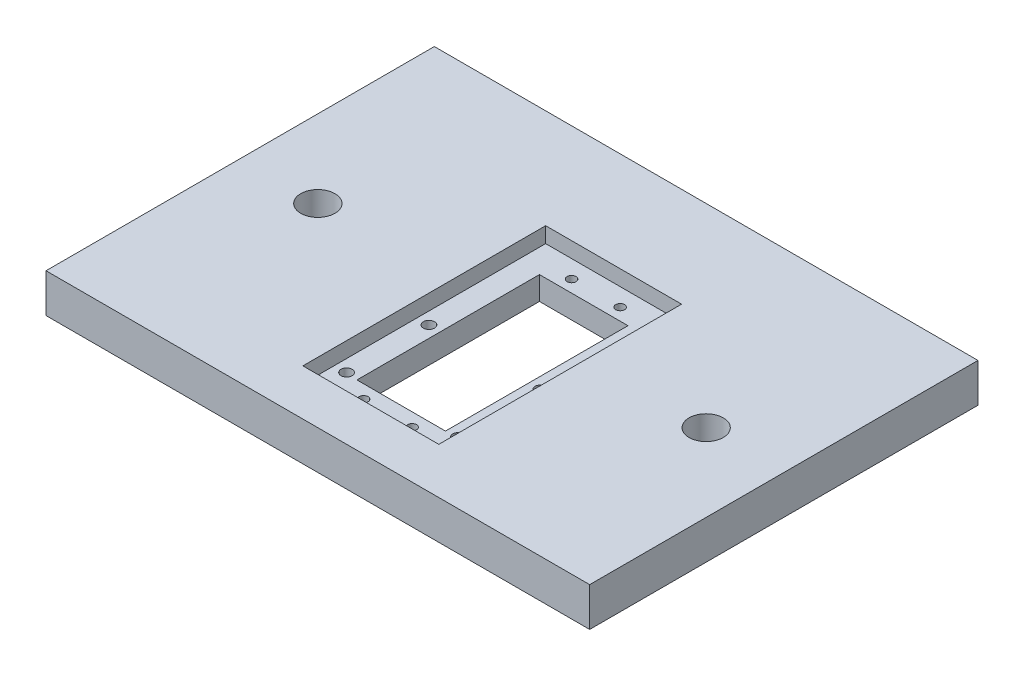
ISO-10303-21;
HEADER;
FILE_DESCRIPTION(('STEP AP214'),'2;1');
FILE_NAME('part.step','',(''),(''),'','','');
FILE_SCHEMA(('AUTOMOTIVE_DESIGN { 1 0 10303 214 1 1 1 1 }'));
ENDSEC;
DATA;
#1=APPLICATION_CONTEXT('core data for automotive mechanical design processes');
#2=APPLICATION_PROTOCOL_DEFINITION('international standard','automotive_design',2000,#1);
#3=PRODUCT_CONTEXT('',#1,'mechanical');
#4=PRODUCT('Part','Part','',(#3));
#5=PRODUCT_RELATED_PRODUCT_CATEGORY('part','',(#4));
#6=PRODUCT_DEFINITION_FORMATION('','',#4);
#7=PRODUCT_DEFINITION_CONTEXT('part definition',#1,'design');
#8=PRODUCT_DEFINITION('design','',#6,#7);
#9=PRODUCT_DEFINITION_SHAPE('','',#8);
#10=(LENGTH_UNIT() NAMED_UNIT(*) SI_UNIT(.MILLI.,.METRE.));
#11=(NAMED_UNIT(*) PLANE_ANGLE_UNIT() SI_UNIT($,.RADIAN.));
#12=(NAMED_UNIT(*) SI_UNIT($,.STERADIAN.) SOLID_ANGLE_UNIT());
#13=UNCERTAINTY_MEASURE_WITH_UNIT(LENGTH_MEASURE(1.E-05),#10,'distance_accuracy_value','');
#14=(GEOMETRIC_REPRESENTATION_CONTEXT(3) GLOBAL_UNCERTAINTY_ASSIGNED_CONTEXT((#13)) GLOBAL_UNIT_ASSIGNED_CONTEXT((#10,
#11,#12)) REPRESENTATION_CONTEXT('',''));
#15=CARTESIAN_POINT('',(0.,0.,0.));
#16=DIRECTION('',(0.,0.,1.));
#17=DIRECTION('',(1.,0.,0.));
#18=AXIS2_PLACEMENT_3D('',#15,#16,#17);
#19=CARTESIAN_POINT('',(20.557934462638,12.7,38.0859099642607));
#20=DIRECTION('',(0.,-1.,0.));
#21=DIRECTION('',(0.,0.,-1.));
#22=AXIS2_PLACEMENT_3D('',#19,#20,#21);
#23=CYLINDRICAL_SURFACE('',#22,1.8288);
#24=CARTESIAN_POINT('',(20.557934462638,0.,38.0859099642607));
#25=DIRECTION('',(0.,1.,0.));
#26=DIRECTION('',(0.,0.,1.));
#27=AXIS2_PLACEMENT_3D('',#24,#25,#26);
#28=CIRCLE('',#27,1.8288);
#29=CARTESIAN_POINT('',(20.557934462638,0.,39.9147099642607));
#30=VERTEX_POINT('',#29);
#31=EDGE_CURVE('E231',#30,#30,#28,.T.);
#32=ORIENTED_EDGE('',*,*,#31,.F.);
#33=EDGE_LOOP('',(#32));
#34=FACE_BOUND('',#33,.T.);
#35=CARTESIAN_POINT('',(20.557934462638,7.62,38.0859099642607));
#36=DIRECTION('',(0.,1.,0.));
#37=DIRECTION('',(0.,0.,1.));
#38=AXIS2_PLACEMENT_3D('',#35,#36,#37);
#39=CIRCLE('',#38,1.8288);
#40=CARTESIAN_POINT('',(20.557934462638,7.62,39.9147099642607));
#41=VERTEX_POINT('',#40);
#42=EDGE_CURVE('E187',#41,#41,#39,.T.);
#43=ORIENTED_EDGE('',*,*,#42,.T.);
#44=EDGE_LOOP('',(#43));
#45=FACE_BOUND('',#44,.T.);
#46=ADVANCED_FACE('F32',(#34,#45),#23,.F.);
#47=CARTESIAN_POINT('',(-16.018065537362,12.7,38.0859099642608));
#48=DIRECTION('',(0.,-1.,0.));
#49=DIRECTION('',(0.,0.,-1.));
#50=AXIS2_PLACEMENT_3D('',#47,#48,#49);
#51=CYLINDRICAL_SURFACE('',#50,1.82880000000002);
#52=CARTESIAN_POINT('',(-16.018065537362,0.,38.0859099642608));
#53=DIRECTION('',(0.,1.,0.));
#54=DIRECTION('',(0.,0.,1.));
#55=AXIS2_PLACEMENT_3D('',#52,#53,#54);
#56=CIRCLE('',#55,1.82880000000002);
#57=CARTESIAN_POINT('',(-16.018065537362,0.,39.9147099642608));
#58=VERTEX_POINT('',#57);
#59=EDGE_CURVE('E228',#58,#58,#56,.T.);
#60=ORIENTED_EDGE('',*,*,#59,.F.);
#61=EDGE_LOOP('',(#60));
#62=FACE_BOUND('',#61,.T.);
#63=CARTESIAN_POINT('',(-16.018065537362,7.62,38.0859099642608));
#64=DIRECTION('',(0.,1.,0.));
#65=DIRECTION('',(0.,0.,1.));
#66=AXIS2_PLACEMENT_3D('',#63,#64,#65);
#67=CIRCLE('',#66,1.82880000000002);
#68=CARTESIAN_POINT('',(-16.018065537362,7.62,39.9147099642608));
#69=VERTEX_POINT('',#68);
#70=EDGE_CURVE('E184',#69,#69,#67,.T.);
#71=ORIENTED_EDGE('',*,*,#70,.T.);
#72=EDGE_LOOP('',(#71));
#73=FACE_BOUND('',#72,.T.);
#74=ADVANCED_FACE('F301',(#62,#73),#51,.F.);
#75=CARTESIAN_POINT('',(-16.018065537362,12.7,11.1451416010532));
#76=DIRECTION('',(0.,-1.,0.));
#77=DIRECTION('',(0.,0.,-1.));
#78=AXIS2_PLACEMENT_3D('',#75,#76,#77);
#79=CYLINDRICAL_SURFACE('',#78,1.8288);
#80=CARTESIAN_POINT('',(-16.018065537362,0.,11.1451416010532));
#81=DIRECTION('',(0.,1.,0.));
#82=DIRECTION('',(0.,0.,1.));
#83=AXIS2_PLACEMENT_3D('',#80,#81,#82);
#84=CIRCLE('',#83,1.8288);
#85=CARTESIAN_POINT('',(-16.018065537362,0.,12.9739416010532));
#86=VERTEX_POINT('',#85);
#87=EDGE_CURVE('E225',#86,#86,#84,.T.);
#88=ORIENTED_EDGE('',*,*,#87,.F.);
#89=EDGE_LOOP('',(#88));
#90=FACE_BOUND('',#89,.T.);
#91=CARTESIAN_POINT('',(-16.018065537362,7.62,11.1451416010532));
#92=DIRECTION('',(0.,1.,0.));
#93=DIRECTION('',(0.,0.,1.));
#94=AXIS2_PLACEMENT_3D('',#91,#92,#93);
#95=CIRCLE('',#94,1.8288);
#96=CARTESIAN_POINT('',(-16.018065537362,7.62,12.9739416010532));
#97=VERTEX_POINT('',#96);
#98=EDGE_CURVE('E181',#97,#97,#95,.T.);
#99=ORIENTED_EDGE('',*,*,#98,.T.);
#100=EDGE_LOOP('',(#99));
#101=FACE_BOUND('',#100,.T.);
#102=ADVANCED_FACE('F308',(#90,#101),#79,.F.);
#103=CARTESIAN_POINT('',(-12.2080655373622,12.7,38.5061507826569));
#104=DIRECTION('',(1.,0.,0.));
#105=DIRECTION('',(0.,0.,-1.));
#106=AXIS2_PLACEMENT_3D('',#103,#104,#105);
#107=PLANE('',#106);
#108=DIRECTION('',(0.,-1.,0.));
#109=VECTOR('',#108,1.);
#110=CARTESIAN_POINT('',(-12.2080655373622,12.7,-21.1838492173431));
#111=LINE('',#110,#109);
#112=CARTESIAN_POINT('',(-12.2080655373622,7.62,-21.1838492173431));
#113=VERTEX_POINT('',#112);
#114=CARTESIAN_POINT('',(-12.2080655373622,0.,-21.1838492173431));
#115=VERTEX_POINT('',#114);
#116=EDGE_CURVE('E217',#113,#115,#111,.T.);
#117=ORIENTED_EDGE('',*,*,#116,.F.);
#118=DIRECTION('',(0.,0.,1.));
#119=VECTOR('',#118,1.);
#120=CARTESIAN_POINT('',(-12.2080655373622,7.62,38.5061507826569));
#121=LINE('',#120,#119);
#122=CARTESIAN_POINT('',(-12.2080655373622,7.62,38.5061507826569));
#123=VERTEX_POINT('',#122);
#124=EDGE_CURVE('E56',#113,#123,#121,.T.);
#125=ORIENTED_EDGE('',*,*,#124,.T.);
#126=DIRECTION('',(0.,-1.,0.));
#127=VECTOR('',#126,1.);
#128=CARTESIAN_POINT('',(-12.2080655373622,12.7,38.5061507826569));
#129=LINE('',#128,#127);
#130=CARTESIAN_POINT('',(-12.2080655373622,0.,38.5061507826569));
#131=VERTEX_POINT('',#130);
#132=EDGE_CURVE('E223',#123,#131,#129,.T.);
#133=ORIENTED_EDGE('',*,*,#132,.T.);
#134=DIRECTION('',(0.,0.,1.));
#135=VECTOR('',#134,1.);
#136=CARTESIAN_POINT('',(-12.2080655373622,0.,38.5061507826569));
#137=LINE('',#136,#135);
#138=EDGE_CURVE('E205',#115,#131,#137,.T.);
#139=ORIENTED_EDGE('',*,*,#138,.F.);
#140=EDGE_LOOP('',(#117,#125,#133,#139));
#141=FACE_BOUND('',#140,.T.);
#142=ADVANCED_FACE('F412',(#141),#107,.T.);
#143=CARTESIAN_POINT('',(-12.2080655373622,12.7,38.5061507826569));
#144=DIRECTION('',(0.,0.,-1.));
#145=DIRECTION('',(-1.,0.,0.));
#146=AXIS2_PLACEMENT_3D('',#143,#144,#145);
#147=PLANE('',#146);
#148=ORIENTED_EDGE('',*,*,#132,.F.);
#149=DIRECTION('',(1.,0.,0.));
#150=VECTOR('',#149,1.);
#151=CARTESIAN_POINT('',(-12.2080655373622,7.62,38.5061507826569));
#152=LINE('',#151,#150);
#153=CARTESIAN_POINT('',(16.7479344626378,7.62,38.5061507826569));
#154=VERTEX_POINT('',#153);
#155=EDGE_CURVE('E177',#123,#154,#152,.T.);
#156=ORIENTED_EDGE('',*,*,#155,.T.);
#157=DIRECTION('',(0.,-1.,0.));
#158=VECTOR('',#157,1.);
#159=CARTESIAN_POINT('',(16.7479344626378,12.7,38.5061507826569));
#160=LINE('',#159,#158);
#161=CARTESIAN_POINT('',(16.7479344626378,0.,38.5061507826569));
#162=VERTEX_POINT('',#161);
#163=EDGE_CURVE('E221',#154,#162,#160,.T.);
#164=ORIENTED_EDGE('',*,*,#163,.T.);
#165=DIRECTION('',(1.,0.,0.));
#166=VECTOR('',#165,1.);
#167=CARTESIAN_POINT('',(-12.2080655373622,0.,38.5061507826569));
#168=LINE('',#167,#166);
#169=EDGE_CURVE('E208',#131,#162,#168,.T.);
#170=ORIENTED_EDGE('',*,*,#169,.F.);
#171=EDGE_LOOP('',(#148,#156,#164,#170));
#172=FACE_BOUND('',#171,.T.);
#173=ADVANCED_FACE('F403',(#172),#147,.T.);
#174=CARTESIAN_POINT('',(16.7479344626378,12.7,38.5061507826569));
#175=DIRECTION('',(-1.,0.,0.));
#176=DIRECTION('',(0.,0.,1.));
#177=AXIS2_PLACEMENT_3D('',#174,#175,#176);
#178=PLANE('',#177);
#179=ORIENTED_EDGE('',*,*,#163,.F.);
#180=DIRECTION('',(0.,0.,-1.));
#181=VECTOR('',#180,1.);
#182=CARTESIAN_POINT('',(16.7479344626378,7.62,38.5061507826569));
#183=LINE('',#182,#181);
#184=CARTESIAN_POINT('',(16.7479344626378,7.62,-21.1838492173431));
#185=VERTEX_POINT('',#184);
#186=EDGE_CURVE('E174',#154,#185,#183,.T.);
#187=ORIENTED_EDGE('',*,*,#186,.T.);
#188=DIRECTION('',(0.,-1.,0.));
#189=VECTOR('',#188,1.);
#190=CARTESIAN_POINT('',(16.7479344626378,12.7,-21.1838492173431));
#191=LINE('',#190,#189);
#192=CARTESIAN_POINT('',(16.7479344626378,0.,-21.1838492173431));
#193=VERTEX_POINT('',#192);
#194=EDGE_CURVE('E219',#185,#193,#191,.T.);
#195=ORIENTED_EDGE('',*,*,#194,.T.);
#196=DIRECTION('',(0.,0.,-1.));
#197=VECTOR('',#196,1.);
#198=CARTESIAN_POINT('',(16.7479344626378,0.,38.5061507826569));
#199=LINE('',#198,#197);
#200=EDGE_CURVE('E211',#162,#193,#199,.T.);
#201=ORIENTED_EDGE('',*,*,#200,.F.);
#202=EDGE_LOOP('',(#179,#187,#195,#201));
#203=FACE_BOUND('',#202,.T.);
#204=ADVANCED_FACE('F394',(#203),#178,.T.);
#205=CARTESIAN_POINT('',(-12.2080655373622,12.7,-21.1838492173431));
#206=DIRECTION('',(0.,0.,1.));
#207=DIRECTION('',(1.,0.,0.));
#208=AXIS2_PLACEMENT_3D('',#205,#206,#207);
#209=PLANE('',#208);
#210=ORIENTED_EDGE('',*,*,#194,.F.);
#211=DIRECTION('',(-1.,0.,0.));
#212=VECTOR('',#211,1.);
#213=CARTESIAN_POINT('',(-12.2080655373622,7.62,-21.1838492173431));
#214=LINE('',#213,#212);
#215=EDGE_CURVE('E172',#185,#113,#214,.T.);
#216=ORIENTED_EDGE('',*,*,#215,.T.);
#217=ORIENTED_EDGE('',*,*,#116,.T.);
#218=DIRECTION('',(-1.,0.,0.));
#219=VECTOR('',#218,1.);
#220=CARTESIAN_POINT('',(-12.2080655373622,0.,-21.1838492173431));
#221=LINE('',#220,#219);
#222=EDGE_CURVE('E214',#193,#115,#221,.T.);
#223=ORIENTED_EDGE('',*,*,#222,.F.);
#224=EDGE_LOOP('',(#210,#216,#217,#223));
#225=FACE_BOUND('',#224,.T.);
#226=ADVANCED_FACE('F385',(#225),#209,.T.);
#227=CARTESIAN_POINT('',(20.557934462638,12.7,11.1451416010531));
#228=DIRECTION('',(0.,-1.,0.));
#229=DIRECTION('',(0.,0.,-1.));
#230=AXIS2_PLACEMENT_3D('',#227,#228,#229);
#231=CYLINDRICAL_SURFACE('',#230,1.8288);
#232=CARTESIAN_POINT('',(20.557934462638,0.,11.1451416010531));
#233=DIRECTION('',(0.,1.,0.));
#234=DIRECTION('',(0.,0.,1.));
#235=AXIS2_PLACEMENT_3D('',#232,#233,#234);
#236=CIRCLE('',#235,1.8288);
#237=CARTESIAN_POINT('',(20.557934462638,0.,12.9739416010531));
#238=VERTEX_POINT('',#237);
#239=EDGE_CURVE('E202',#238,#238,#236,.T.);
#240=ORIENTED_EDGE('',*,*,#239,.F.);
#241=EDGE_LOOP('',(#240));
#242=FACE_BOUND('',#241,.T.);
#243=CARTESIAN_POINT('',(20.557934462638,7.62,11.1451416010531));
#244=DIRECTION('',(0.,1.,0.));
#245=DIRECTION('',(0.,0.,1.));
#246=AXIS2_PLACEMENT_3D('',#243,#244,#245);
#247=CIRCLE('',#246,1.8288);
#248=CARTESIAN_POINT('',(20.557934462638,7.62,12.9739416010531));
#249=VERTEX_POINT('',#248);
#250=EDGE_CURVE('E169',#249,#249,#247,.T.);
#251=ORIENTED_EDGE('',*,*,#250,.T.);
#252=EDGE_LOOP('',(#251));
#253=FACE_BOUND('',#252,.T.);
#254=ADVANCED_FACE('F376',(#242,#253),#231,.F.);
#255=CARTESIAN_POINT('',(-5.66756553736215,12.7,42.8717757826569));
#256=DIRECTION('',(0.,-1.,0.));
#257=DIRECTION('',(0.,0.,-1.));
#258=AXIS2_PLACEMENT_3D('',#255,#256,#257);
#259=CYLINDRICAL_SURFACE('',#258,1.4605);
#260=CARTESIAN_POINT('',(-5.66756553736215,0.,42.8717757826569));
#261=DIRECTION('',(0.,1.,0.));
#262=DIRECTION('',(0.,0.,1.));
#263=AXIS2_PLACEMENT_3D('',#260,#261,#262);
#264=CIRCLE('',#263,1.4605);
#265=CARTESIAN_POINT('',(-5.66756553736215,0.,44.3322757826569));
#266=VERTEX_POINT('',#265);
#267=EDGE_CURVE('E199',#266,#266,#264,.T.);
#268=ORIENTED_EDGE('',*,*,#267,.F.);
#269=EDGE_LOOP('',(#268));
#270=FACE_BOUND('',#269,.T.);
#271=CARTESIAN_POINT('',(-5.66756553736215,7.62,42.8717757826569));
#272=DIRECTION('',(0.,1.,0.));
#273=DIRECTION('',(0.,0.,1.));
#274=AXIS2_PLACEMENT_3D('',#271,#272,#273);
#275=CIRCLE('',#274,1.4605);
#276=CARTESIAN_POINT('',(-5.66756553736215,7.62,44.3322757826569));
#277=VERTEX_POINT('',#276);
#278=EDGE_CURVE('E166',#277,#277,#275,.T.);
#279=ORIENTED_EDGE('',*,*,#278,.T.);
#280=EDGE_LOOP('',(#279));
#281=FACE_BOUND('',#280,.T.);
#282=ADVANCED_FACE('F367',(#270,#281),#259,.F.);
#283=CARTESIAN_POINT('',(10.2074344626378,12.7,42.8717757826569));
#284=DIRECTION('',(0.,-1.,0.));
#285=DIRECTION('',(0.,0.,-1.));
#286=AXIS2_PLACEMENT_3D('',#283,#284,#285);
#287=CYLINDRICAL_SURFACE('',#286,1.4605);
#288=CARTESIAN_POINT('',(10.2074344626378,0.,42.8717757826569));
#289=DIRECTION('',(0.,1.,0.));
#290=DIRECTION('',(0.,0.,1.));
#291=AXIS2_PLACEMENT_3D('',#288,#289,#290);
#292=CIRCLE('',#291,1.4605);
#293=CARTESIAN_POINT('',(10.2074344626378,0.,44.3322757826569));
#294=VERTEX_POINT('',#293);
#295=EDGE_CURVE('E196',#294,#294,#292,.T.);
#296=ORIENTED_EDGE('',*,*,#295,.F.);
#297=EDGE_LOOP('',(#296));
#298=FACE_BOUND('',#297,.T.);
#299=CARTESIAN_POINT('',(10.2074344626378,7.62,42.8717757826569));
#300=DIRECTION('',(0.,1.,0.));
#301=DIRECTION('',(0.,0.,1.));
#302=AXIS2_PLACEMENT_3D('',#299,#300,#301);
#303=CIRCLE('',#302,1.4605);
#304=CARTESIAN_POINT('',(10.2074344626378,7.62,44.3322757826569));
#305=VERTEX_POINT('',#304);
#306=EDGE_CURVE('E163',#305,#305,#303,.T.);
#307=ORIENTED_EDGE('',*,*,#306,.T.);
#308=EDGE_LOOP('',(#307));
#309=FACE_BOUND('',#308,.T.);
#310=ADVANCED_FACE('F358',(#298,#309),#287,.F.);
#311=CARTESIAN_POINT('',(-5.66756553736239,12.7,-25.1494242173431));
#312=DIRECTION('',(0.,-1.,0.));
#313=DIRECTION('',(0.,0.,-1.));
#314=AXIS2_PLACEMENT_3D('',#311,#312,#313);
#315=CYLINDRICAL_SURFACE('',#314,1.4605);
#316=CARTESIAN_POINT('',(-5.66756553736239,0.,-25.1494242173431));
#317=DIRECTION('',(0.,1.,0.));
#318=DIRECTION('',(0.,0.,1.));
#319=AXIS2_PLACEMENT_3D('',#316,#317,#318);
#320=CIRCLE('',#319,1.4605);
#321=CARTESIAN_POINT('',(-5.66756553736239,0.,-23.6889242173431));
#322=VERTEX_POINT('',#321);
#323=EDGE_CURVE('E193',#322,#322,#320,.T.);
#324=ORIENTED_EDGE('',*,*,#323,.F.);
#325=EDGE_LOOP('',(#324));
#326=FACE_BOUND('',#325,.T.);
#327=CARTESIAN_POINT('',(-5.66756553736239,7.62,-25.1494242173431));
#328=DIRECTION('',(0.,1.,0.));
#329=DIRECTION('',(0.,0.,1.));
#330=AXIS2_PLACEMENT_3D('',#327,#328,#329);
#331=CIRCLE('',#330,1.4605);
#332=CARTESIAN_POINT('',(-5.66756553736239,7.62,-23.6889242173431));
#333=VERTEX_POINT('',#332);
#334=EDGE_CURVE('E160',#333,#333,#331,.T.);
#335=ORIENTED_EDGE('',*,*,#334,.T.);
#336=EDGE_LOOP('',(#335));
#337=FACE_BOUND('',#336,.T.);
#338=ADVANCED_FACE('F349',(#326,#337),#315,.F.);
#339=CARTESIAN_POINT('',(10.2074344626376,12.7,-25.1494242173431));
#340=DIRECTION('',(0.,-1.,0.));
#341=DIRECTION('',(0.,0.,-1.));
#342=AXIS2_PLACEMENT_3D('',#339,#340,#341);
#343=CYLINDRICAL_SURFACE('',#342,1.4605);
#344=CARTESIAN_POINT('',(10.2074344626376,0.,-25.1494242173431));
#345=DIRECTION('',(0.,1.,0.));
#346=DIRECTION('',(0.,0.,1.));
#347=AXIS2_PLACEMENT_3D('',#344,#345,#346);
#348=CIRCLE('',#347,1.4605);
#349=CARTESIAN_POINT('',(10.2074344626376,0.,-23.6889242173431));
#350=VERTEX_POINT('',#349);
#351=EDGE_CURVE('E190',#350,#350,#348,.T.);
#352=ORIENTED_EDGE('',*,*,#351,.F.);
#353=EDGE_LOOP('',(#352));
#354=FACE_BOUND('',#353,.T.);
#355=CARTESIAN_POINT('',(10.2074344626376,7.62,-25.1494242173431));
#356=DIRECTION('',(0.,1.,0.));
#357=DIRECTION('',(0.,0.,1.));
#358=AXIS2_PLACEMENT_3D('',#355,#356,#357);
#359=CIRCLE('',#358,1.4605);
#360=CARTESIAN_POINT('',(10.2074344626376,7.62,-23.6889242173431));
#361=VERTEX_POINT('',#360);
#362=EDGE_CURVE('E36',#361,#361,#359,.T.);
#363=ORIENTED_EDGE('',*,*,#362,.T.);
#364=EDGE_LOOP('',(#363));
#365=FACE_BOUND('',#364,.T.);
#366=ADVANCED_FACE('F325',(#354,#365),#343,.F.);
#367=CARTESIAN_POINT('',(0.,12.7,0.));
#368=DIRECTION('',(0.,1.,0.));
#369=DIRECTION('',(0.,0.,1.));
#370=AXIS2_PLACEMENT_3D('',#367,#368,#369);
#371=PLANE('',#370);
#372=DIRECTION('',(0.,0.,-1.));
#373=VECTOR('',#372,1.);
#374=CARTESIAN_POINT('',(24.4949344626378,12.7,-30.9628492173431));
#375=LINE('',#374,#373);
#376=CARTESIAN_POINT('',(24.4949344626378,12.7,48.4375507826569));
#377=VERTEX_POINT('',#376);
#378=CARTESIAN_POINT('',(24.4949344626378,12.7,-30.9628492173431));
#379=VERTEX_POINT('',#378);
#380=EDGE_CURVE('E48',#377,#379,#375,.T.);
#381=ORIENTED_EDGE('',*,*,#380,.F.);
#382=DIRECTION('',(1.,0.,0.));
#383=VECTOR('',#382,1.);
#384=CARTESIAN_POINT('',(-19.9550655373622,12.7,48.4375507826569));
#385=LINE('',#384,#383);
#386=CARTESIAN_POINT('',(-19.9550655373622,12.7,48.4375507826569));
#387=VERTEX_POINT('',#386);
#388=EDGE_CURVE('E142',#387,#377,#385,.T.);
#389=ORIENTED_EDGE('',*,*,#388,.F.);
#390=DIRECTION('',(0.,0.,1.));
#391=VECTOR('',#390,1.);
#392=CARTESIAN_POINT('',(-19.9550655373621,12.7,-30.9628492173431));
#393=LINE('',#392,#391);
#394=CARTESIAN_POINT('',(-19.9550655373621,12.7,-30.9628492173431));
#395=VERTEX_POINT('',#394);
#396=EDGE_CURVE('E145',#395,#387,#393,.T.);
#397=ORIENTED_EDGE('',*,*,#396,.F.);
#398=DIRECTION('',(-1.,0.,0.));
#399=VECTOR('',#398,1.);
#400=CARTESIAN_POINT('',(-19.9550655373621,12.7,-30.9628492173431));
#401=LINE('',#400,#399);
#402=EDGE_CURVE('E151',#379,#395,#401,.T.);
#403=ORIENTED_EDGE('',*,*,#402,.F.);
#404=EDGE_LOOP('',(#381,#389,#397,#403));
#405=FACE_BOUND('',#404,.T.);
#406=CARTESIAN_POINT('',(-63.5,12.7,0.));
#407=DIRECTION('',(0.,1.,0.));
#408=DIRECTION('',(0.,0.,1.));
#409=AXIS2_PLACEMENT_3D('',#406,#407,#408);
#410=CIRCLE('',#409,5.58799999999999);
#411=CARTESIAN_POINT('',(-63.5,12.7,5.58799999999999));
#412=VERTEX_POINT('',#411);
#413=EDGE_CURVE('E241',#412,#412,#410,.T.);
#414=ORIENTED_EDGE('',*,*,#413,.F.);
#415=EDGE_LOOP('',(#414));
#416=FACE_BOUND('',#415,.T.);
#417=DIRECTION('',(0.,0.,-1.));
#418=VECTOR('',#417,1.);
#419=CARTESIAN_POINT('',(88.9,12.7,-63.5));
#420=LINE('',#419,#418);
#421=CARTESIAN_POINT('',(88.9,12.7,63.5));
#422=VERTEX_POINT('',#421);
#423=CARTESIAN_POINT('',(88.9,12.7,-63.5));
#424=VERTEX_POINT('',#423);
#425=EDGE_CURVE('E247',#422,#424,#420,.T.);
#426=ORIENTED_EDGE('',*,*,#425,.T.);
#427=DIRECTION('',(-1.,0.,0.));
#428=VECTOR('',#427,1.);
#429=CARTESIAN_POINT('',(-88.9,12.7,-63.5));
#430=LINE('',#429,#428);
#431=CARTESIAN_POINT('',(-88.9,12.7,-63.5));
#432=VERTEX_POINT('',#431);
#433=EDGE_CURVE('E250',#424,#432,#430,.T.);
#434=ORIENTED_EDGE('',*,*,#433,.T.);
#435=DIRECTION('',(0.,0.,1.));
#436=VECTOR('',#435,1.);
#437=CARTESIAN_POINT('',(-88.9,12.7,-63.5));
#438=LINE('',#437,#436);
#439=CARTESIAN_POINT('',(-88.9,12.7,63.5));
#440=VERTEX_POINT('',#439);
#441=EDGE_CURVE('E253',#432,#440,#438,.T.);
#442=ORIENTED_EDGE('',*,*,#441,.T.);
#443=DIRECTION('',(1.,0.,0.));
#444=VECTOR('',#443,1.);
#445=CARTESIAN_POINT('',(-88.9,12.7,63.5));
#446=LINE('',#445,#444);
#447=EDGE_CURVE('E255',#440,#422,#446,.T.);
#448=ORIENTED_EDGE('',*,*,#447,.T.);
#449=EDGE_LOOP('',(#426,#434,#442,#448));
#450=FACE_BOUND('',#449,.T.);
#451=CARTESIAN_POINT('',(63.5,12.7,0.));
#452=DIRECTION('',(0.,1.,0.));
#453=DIRECTION('',(0.,0.,1.));
#454=AXIS2_PLACEMENT_3D('',#451,#452,#453);
#455=CIRCLE('',#454,5.58799999999999);
#456=CARTESIAN_POINT('',(63.5,12.7,5.58799999999999));
#457=VERTEX_POINT('',#456);
#458=EDGE_CURVE('E235',#457,#457,#455,.T.);
#459=ORIENTED_EDGE('',*,*,#458,.F.);
#460=EDGE_LOOP('',(#459));
#461=FACE_BOUND('',#460,.T.);
#462=ADVANCED_FACE('F291',(#405,#416,#450,#461),#371,.T.);
#463=CARTESIAN_POINT('',(0.,0.,0.));
#464=DIRECTION('',(0.,1.,0.));
#465=DIRECTION('',(0.,0.,1.));
#466=AXIS2_PLACEMENT_3D('',#463,#464,#465);
#467=PLANE('',#466);
#468=ORIENTED_EDGE('',*,*,#87,.T.);
#469=EDGE_LOOP('',(#468));
#470=FACE_BOUND('',#469,.T.);
#471=ORIENTED_EDGE('',*,*,#59,.T.);
#472=EDGE_LOOP('',(#471));
#473=FACE_BOUND('',#472,.T.);
#474=ORIENTED_EDGE('',*,*,#31,.T.);
#475=EDGE_LOOP('',(#474));
#476=FACE_BOUND('',#475,.T.);
#477=CARTESIAN_POINT('',(63.5,0.,0.));
#478=DIRECTION('',(0.,1.,0.));
#479=DIRECTION('',(0.,0.,1.));
#480=AXIS2_PLACEMENT_3D('',#477,#478,#479);
#481=CIRCLE('',#480,5.58799999999999);
#482=CARTESIAN_POINT('',(63.5,0.,5.58799999999999));
#483=VERTEX_POINT('',#482);
#484=EDGE_CURVE('E234',#483,#483,#481,.T.);
#485=ORIENTED_EDGE('',*,*,#484,.T.);
#486=EDGE_LOOP('',(#485));
#487=FACE_BOUND('',#486,.T.);
#488=CARTESIAN_POINT('',(-63.5,0.,0.));
#489=DIRECTION('',(0.,1.,0.));
#490=DIRECTION('',(0.,0.,1.));
#491=AXIS2_PLACEMENT_3D('',#488,#489,#490);
#492=CIRCLE('',#491,5.58799999999999);
#493=CARTESIAN_POINT('',(-63.5,0.,5.58799999999999));
#494=VERTEX_POINT('',#493);
#495=EDGE_CURVE('E238',#494,#494,#492,.T.);
#496=ORIENTED_EDGE('',*,*,#495,.T.);
#497=EDGE_LOOP('',(#496));
#498=FACE_BOUND('',#497,.T.);
#499=DIRECTION('',(0.,0.,-1.));
#500=VECTOR('',#499,1.);
#501=CARTESIAN_POINT('',(88.9,0.,-63.5));
#502=LINE('',#501,#500);
#503=CARTESIAN_POINT('',(88.9,0.,63.5));
#504=VERTEX_POINT('',#503);
#505=CARTESIAN_POINT('',(88.9,0.,-63.5));
#506=VERTEX_POINT('',#505);
#507=EDGE_CURVE('E244',#504,#506,#502,.T.);
#508=ORIENTED_EDGE('',*,*,#507,.F.);
#509=DIRECTION('',(1.,0.,0.));
#510=VECTOR('',#509,1.);
#511=CARTESIAN_POINT('',(-88.9,0.,63.5));
#512=LINE('',#511,#510);
#513=CARTESIAN_POINT('',(-88.9,0.,63.5));
#514=VERTEX_POINT('',#513);
#515=EDGE_CURVE('E251',#514,#504,#512,.T.);
#516=ORIENTED_EDGE('',*,*,#515,.F.);
#517=DIRECTION('',(0.,0.,1.));
#518=VECTOR('',#517,1.);
#519=CARTESIAN_POINT('',(-88.9,0.,-63.5));
#520=LINE('',#519,#518);
#521=CARTESIAN_POINT('',(-88.9,0.,-63.5));
#522=VERTEX_POINT('',#521);
#523=EDGE_CURVE('E262',#522,#514,#520,.T.);
#524=ORIENTED_EDGE('',*,*,#523,.F.);
#525=DIRECTION('',(-1.,0.,0.));
#526=VECTOR('',#525,1.);
#527=CARTESIAN_POINT('',(-88.9,0.,-63.5));
#528=LINE('',#527,#526);
#529=EDGE_CURVE('E260',#506,#522,#528,.T.);
#530=ORIENTED_EDGE('',*,*,#529,.F.);
#531=EDGE_LOOP('',(#508,#516,#524,#530));
#532=FACE_BOUND('',#531,.T.);
#533=ORIENTED_EDGE('',*,*,#138,.T.);
#534=ORIENTED_EDGE('',*,*,#169,.T.);
#535=ORIENTED_EDGE('',*,*,#200,.T.);
#536=ORIENTED_EDGE('',*,*,#222,.T.);
#537=EDGE_LOOP('',(#533,#534,#535,#536));
#538=FACE_BOUND('',#537,.T.);
#539=ORIENTED_EDGE('',*,*,#239,.T.);
#540=EDGE_LOOP('',(#539));
#541=FACE_BOUND('',#540,.T.);
#542=ORIENTED_EDGE('',*,*,#267,.T.);
#543=EDGE_LOOP('',(#542));
#544=FACE_BOUND('',#543,.T.);
#545=ORIENTED_EDGE('',*,*,#295,.T.);
#546=EDGE_LOOP('',(#545));
#547=FACE_BOUND('',#546,.T.);
#548=ORIENTED_EDGE('',*,*,#323,.T.);
#549=EDGE_LOOP('',(#548));
#550=FACE_BOUND('',#549,.T.);
#551=ORIENTED_EDGE('',*,*,#351,.T.);
#552=EDGE_LOOP('',(#551));
#553=FACE_BOUND('',#552,.T.);
#554=ADVANCED_FACE('F281',(#470,#473,#476,#487,#498,#532,#538,#541,#544,#547,#550,#553),#467,.F.);
#555=CARTESIAN_POINT('',(88.9,12.7,-63.5));
#556=DIRECTION('',(-1.,0.,0.));
#557=DIRECTION('',(0.,0.,1.));
#558=AXIS2_PLACEMENT_3D('',#555,#556,#557);
#559=PLANE('',#558);
#560=ORIENTED_EDGE('',*,*,#507,.T.);
#561=DIRECTION('',(0.,-1.,0.));
#562=VECTOR('',#561,1.);
#563=CARTESIAN_POINT('',(88.9,12.7,-63.5));
#564=LINE('',#563,#562);
#565=EDGE_CURVE('E11',#424,#506,#564,.T.);
#566=ORIENTED_EDGE('',*,*,#565,.F.);
#567=ORIENTED_EDGE('',*,*,#425,.F.);
#568=DIRECTION('',(0.,-1.,0.));
#569=VECTOR('',#568,1.);
#570=CARTESIAN_POINT('',(88.9,12.7,63.5));
#571=LINE('',#570,#569);
#572=EDGE_CURVE('E257',#422,#504,#571,.T.);
#573=ORIENTED_EDGE('',*,*,#572,.T.);
#574=EDGE_LOOP('',(#560,#566,#567,#573));
#575=FACE_BOUND('',#574,.T.);
#576=ADVANCED_FACE('F34',(#575),#559,.F.);
#577=CARTESIAN_POINT('',(-88.9,12.7,-63.5));
#578=DIRECTION('',(0.,0.,1.));
#579=DIRECTION('',(1.,0.,0.));
#580=AXIS2_PLACEMENT_3D('',#577,#578,#579);
#581=PLANE('',#580);
#582=ORIENTED_EDGE('',*,*,#529,.T.);
#583=DIRECTION('',(0.,-1.,0.));
#584=VECTOR('',#583,1.);
#585=CARTESIAN_POINT('',(-88.9,12.7,-63.5));
#586=LINE('',#585,#584);
#587=EDGE_CURVE('E41',#432,#522,#586,.T.);
#588=ORIENTED_EDGE('',*,*,#587,.F.);
#589=ORIENTED_EDGE('',*,*,#433,.F.);
#590=ORIENTED_EDGE('',*,*,#565,.T.);
#591=EDGE_LOOP('',(#582,#588,#589,#590));
#592=FACE_BOUND('',#591,.T.);
#593=ADVANCED_FACE('F293',(#592),#581,.F.);
#594=CARTESIAN_POINT('',(-88.9,12.7,-63.5));
#595=DIRECTION('',(1.,0.,0.));
#596=DIRECTION('',(0.,0.,-1.));
#597=AXIS2_PLACEMENT_3D('',#594,#595,#596);
#598=PLANE('',#597);
#599=ORIENTED_EDGE('',*,*,#523,.T.);
#600=DIRECTION('',(0.,-1.,0.));
#601=VECTOR('',#600,1.);
#602=CARTESIAN_POINT('',(-88.9,12.7,63.5));
#603=LINE('',#602,#601);
#604=EDGE_CURVE('E267',#440,#514,#603,.T.);
#605=ORIENTED_EDGE('',*,*,#604,.F.);
#606=ORIENTED_EDGE('',*,*,#441,.F.);
#607=ORIENTED_EDGE('',*,*,#587,.T.);
#608=EDGE_LOOP('',(#599,#605,#606,#607));
#609=FACE_BOUND('',#608,.T.);
#610=ADVANCED_FACE('F275',(#609),#598,.F.);
#611=CARTESIAN_POINT('',(-88.9,12.7,63.5));
#612=DIRECTION('',(0.,0.,-1.));
#613=DIRECTION('',(-1.,0.,0.));
#614=AXIS2_PLACEMENT_3D('',#611,#612,#613);
#615=PLANE('',#614);
#616=ORIENTED_EDGE('',*,*,#515,.T.);
#617=ORIENTED_EDGE('',*,*,#572,.F.);
#618=ORIENTED_EDGE('',*,*,#447,.F.);
#619=ORIENTED_EDGE('',*,*,#604,.T.);
#620=EDGE_LOOP('',(#616,#617,#618,#619));
#621=FACE_BOUND('',#620,.T.);
#622=ADVANCED_FACE('F285',(#621),#615,.F.);
#623=CARTESIAN_POINT('',(-63.5,12.7,0.));
#624=DIRECTION('',(0.,-1.,0.));
#625=DIRECTION('',(0.,0.,-1.));
#626=AXIS2_PLACEMENT_3D('',#623,#624,#625);
#627=CYLINDRICAL_SURFACE('',#626,5.58799999999999);
#628=ORIENTED_EDGE('',*,*,#413,.T.);
#629=EDGE_LOOP('',(#628));
#630=FACE_BOUND('',#629,.T.);
#631=ORIENTED_EDGE('',*,*,#495,.F.);
#632=EDGE_LOOP('',(#631));
#633=FACE_BOUND('',#632,.T.);
#634=ADVANCED_FACE('F318',(#630,#633),#627,.F.);
#635=CARTESIAN_POINT('',(63.5,12.7,0.));
#636=DIRECTION('',(0.,-1.,0.));
#637=DIRECTION('',(0.,0.,-1.));
#638=AXIS2_PLACEMENT_3D('',#635,#636,#637);
#639=CYLINDRICAL_SURFACE('',#638,5.58799999999999);
#640=ORIENTED_EDGE('',*,*,#458,.T.);
#641=EDGE_LOOP('',(#640));
#642=FACE_BOUND('',#641,.T.);
#643=ORIENTED_EDGE('',*,*,#484,.F.);
#644=EDGE_LOOP('',(#643));
#645=FACE_BOUND('',#644,.T.);
#646=ADVANCED_FACE('F315',(#642,#645),#639,.F.);
#647=CARTESIAN_POINT('',(24.4949344626378,7.62,-30.9628492173431));
#648=DIRECTION('',(1.,0.,0.));
#649=DIRECTION('',(0.,0.,-1.));
#650=AXIS2_PLACEMENT_3D('',#647,#648,#649);
#651=PLANE('',#650);
#652=ORIENTED_EDGE('',*,*,#380,.T.);
#653=DIRECTION('',(0.,1.,0.));
#654=VECTOR('',#653,1.);
#655=CARTESIAN_POINT('',(24.4949344626378,7.62,-30.9628492173431));
#656=LINE('',#655,#654);
#657=CARTESIAN_POINT('',(24.4949344626378,7.62,-30.9628492173431));
#658=VERTEX_POINT('',#657);
#659=EDGE_CURVE('E120',#658,#379,#656,.T.);
#660=ORIENTED_EDGE('',*,*,#659,.F.);
#661=DIRECTION('',(0.,0.,-1.));
#662=VECTOR('',#661,1.);
#663=CARTESIAN_POINT('',(24.4949344626378,7.62,-30.9628492173431));
#664=LINE('',#663,#662);
#665=CARTESIAN_POINT('',(24.4949344626378,7.62,48.4375507826569));
#666=VERTEX_POINT('',#665);
#667=EDGE_CURVE('E124',#666,#658,#664,.T.);
#668=ORIENTED_EDGE('',*,*,#667,.F.);
#669=DIRECTION('',(0.,1.,0.));
#670=VECTOR('',#669,1.);
#671=CARTESIAN_POINT('',(24.4949344626378,7.62,48.4375507826569));
#672=LINE('',#671,#670);
#673=EDGE_CURVE('E155',#666,#377,#672,.T.);
#674=ORIENTED_EDGE('',*,*,#673,.T.);
#675=EDGE_LOOP('',(#652,#660,#668,#674));
#676=FACE_BOUND('',#675,.T.);
#677=ADVANCED_FACE('F122',(#676),#651,.F.);
#678=CARTESIAN_POINT('',(-19.9550655373622,7.62,48.4375507826569));
#679=DIRECTION('',(0.,0.,1.));
#680=DIRECTION('',(1.,0.,0.));
#681=AXIS2_PLACEMENT_3D('',#678,#679,#680);
#682=PLANE('',#681);
#683=ORIENTED_EDGE('',*,*,#388,.T.);
#684=ORIENTED_EDGE('',*,*,#673,.F.);
#685=DIRECTION('',(1.,0.,0.));
#686=VECTOR('',#685,1.);
#687=CARTESIAN_POINT('',(-19.9550655373622,7.62,48.4375507826569));
#688=LINE('',#687,#686);
#689=CARTESIAN_POINT('',(-19.9550655373622,7.62,48.4375507826569));
#690=VERTEX_POINT('',#689);
#691=EDGE_CURVE('E130',#690,#666,#688,.T.);
#692=ORIENTED_EDGE('',*,*,#691,.F.);
#693=DIRECTION('',(0.,1.,0.));
#694=VECTOR('',#693,1.);
#695=CARTESIAN_POINT('',(-19.9550655373622,7.62,48.4375507826569));
#696=LINE('',#695,#694);
#697=EDGE_CURVE('E157',#690,#387,#696,.T.);
#698=ORIENTED_EDGE('',*,*,#697,.T.);
#699=EDGE_LOOP('',(#683,#684,#692,#698));
#700=FACE_BOUND('',#699,.T.);
#701=ADVANCED_FACE('F445',(#700),#682,.F.);
#702=CARTESIAN_POINT('',(-19.9550655373621,7.62,-30.9628492173431));
#703=DIRECTION('',(-1.,0.,0.));
#704=DIRECTION('',(0.,0.,1.));
#705=AXIS2_PLACEMENT_3D('',#702,#703,#704);
#706=PLANE('',#705);
#707=ORIENTED_EDGE('',*,*,#396,.T.);
#708=ORIENTED_EDGE('',*,*,#697,.F.);
#709=DIRECTION('',(0.,0.,1.));
#710=VECTOR('',#709,1.);
#711=CARTESIAN_POINT('',(-19.9550655373621,7.62,-30.9628492173431));
#712=LINE('',#711,#710);
#713=CARTESIAN_POINT('',(-19.9550655373621,7.62,-30.9628492173431));
#714=VERTEX_POINT('',#713);
#715=EDGE_CURVE('E138',#714,#690,#712,.T.);
#716=ORIENTED_EDGE('',*,*,#715,.F.);
#717=DIRECTION('',(0.,1.,0.));
#718=VECTOR('',#717,1.);
#719=CARTESIAN_POINT('',(-19.9550655373621,7.62,-30.9628492173431));
#720=LINE('',#719,#718);
#721=EDGE_CURVE('E129',#714,#395,#720,.T.);
#722=ORIENTED_EDGE('',*,*,#721,.T.);
#723=EDGE_LOOP('',(#707,#708,#716,#722));
#724=FACE_BOUND('',#723,.T.);
#725=ADVANCED_FACE('F451',(#724),#706,.F.);
#726=CARTESIAN_POINT('',(-19.9550655373621,7.62,-30.9628492173431));
#727=DIRECTION('',(0.,0.,-1.));
#728=DIRECTION('',(-1.,0.,0.));
#729=AXIS2_PLACEMENT_3D('',#726,#727,#728);
#730=PLANE('',#729);
#731=ORIENTED_EDGE('',*,*,#402,.T.);
#732=ORIENTED_EDGE('',*,*,#721,.F.);
#733=DIRECTION('',(-1.,0.,0.));
#734=VECTOR('',#733,1.);
#735=CARTESIAN_POINT('',(-19.9550655373621,7.62,-30.9628492173431));
#736=LINE('',#735,#734);
#737=EDGE_CURVE('E133',#658,#714,#736,.T.);
#738=ORIENTED_EDGE('',*,*,#737,.F.);
#739=ORIENTED_EDGE('',*,*,#659,.T.);
#740=EDGE_LOOP('',(#731,#732,#738,#739));
#741=FACE_BOUND('',#740,.T.);
#742=ADVANCED_FACE('F134',(#741),#730,.F.);
#743=CARTESIAN_POINT('',(0.,7.62,0.));
#744=DIRECTION('',(0.,1.,0.));
#745=DIRECTION('',(0.,0.,1.));
#746=AXIS2_PLACEMENT_3D('',#743,#744,#745);
#747=PLANE('',#746);
#748=ORIENTED_EDGE('',*,*,#42,.F.);
#749=EDGE_LOOP('',(#748));
#750=FACE_BOUND('',#749,.T.);
#751=ORIENTED_EDGE('',*,*,#70,.F.);
#752=EDGE_LOOP('',(#751));
#753=FACE_BOUND('',#752,.T.);
#754=ORIENTED_EDGE('',*,*,#98,.F.);
#755=EDGE_LOOP('',(#754));
#756=FACE_BOUND('',#755,.T.);
#757=ORIENTED_EDGE('',*,*,#215,.F.);
#758=ORIENTED_EDGE('',*,*,#186,.F.);
#759=ORIENTED_EDGE('',*,*,#155,.F.);
#760=ORIENTED_EDGE('',*,*,#124,.F.);
#761=EDGE_LOOP('',(#757,#758,#759,#760));
#762=FACE_BOUND('',#761,.T.);
#763=ORIENTED_EDGE('',*,*,#250,.F.);
#764=EDGE_LOOP('',(#763));
#765=FACE_BOUND('',#764,.T.);
#766=ORIENTED_EDGE('',*,*,#278,.F.);
#767=EDGE_LOOP('',(#766));
#768=FACE_BOUND('',#767,.T.);
#769=ORIENTED_EDGE('',*,*,#306,.F.);
#770=EDGE_LOOP('',(#769));
#771=FACE_BOUND('',#770,.T.);
#772=ORIENTED_EDGE('',*,*,#334,.F.);
#773=EDGE_LOOP('',(#772));
#774=FACE_BOUND('',#773,.T.);
#775=ORIENTED_EDGE('',*,*,#362,.F.);
#776=EDGE_LOOP('',(#775));
#777=FACE_BOUND('',#776,.T.);
#778=ORIENTED_EDGE('',*,*,#667,.T.);
#779=ORIENTED_EDGE('',*,*,#737,.T.);
#780=ORIENTED_EDGE('',*,*,#715,.T.);
#781=ORIENTED_EDGE('',*,*,#691,.T.);
#782=EDGE_LOOP('',(#778,#779,#780,#781));
#783=FACE_BOUND('',#782,.T.);
#784=ADVANCED_FACE('F140',(#750,#753,#756,#762,#765,#768,#771,#774,#777,#783),#747,.T.);
#785=CLOSED_SHELL('',(#46,#74,#102,#142,#173,#204,#226,#254,#282,#310,#338,#366,#462,#554,#576,
#593,#610,#622,#634,#646,#677,#701,#725,#742,#784));
#786=MANIFOLD_SOLID_BREP('B2',#785);
#787=ADVANCED_BREP_SHAPE_REPRESENTATION('',(#18,#786),#14);
#788=SHAPE_DEFINITION_REPRESENTATION(#9,#787);
ENDSEC;
END-ISO-10303-21;
